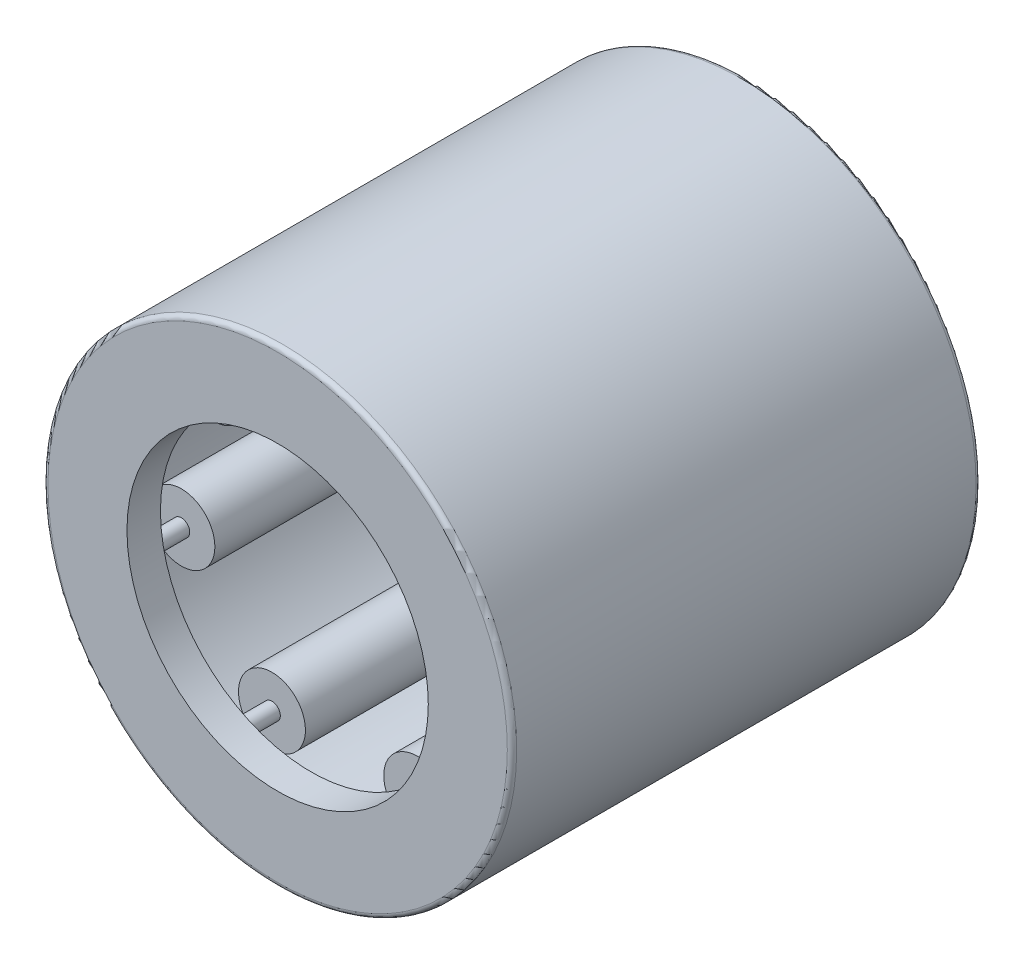
ISO-10303-21;
HEADER;
FILE_DESCRIPTION(('STEP AP214'),'2;1');
FILE_NAME('part.step','',(''),(''),'','','');
FILE_SCHEMA(('AUTOMOTIVE_DESIGN { 1 0 10303 214 1 1 1 1 }'));
ENDSEC;
DATA;
#1=APPLICATION_CONTEXT('core data for automotive mechanical design processes');
#2=APPLICATION_PROTOCOL_DEFINITION('international standard','automotive_design',2000,#1);
#3=PRODUCT_CONTEXT('',#1,'mechanical');
#4=PRODUCT('Part','Part','',(#3));
#5=PRODUCT_RELATED_PRODUCT_CATEGORY('part','',(#4));
#6=PRODUCT_DEFINITION_FORMATION('','',#4);
#7=PRODUCT_DEFINITION_CONTEXT('part definition',#1,'design');
#8=PRODUCT_DEFINITION('design','',#6,#7);
#9=PRODUCT_DEFINITION_SHAPE('','',#8);
#10=(LENGTH_UNIT() NAMED_UNIT(*) SI_UNIT(.MILLI.,.METRE.));
#11=(NAMED_UNIT(*) PLANE_ANGLE_UNIT() SI_UNIT($,.RADIAN.));
#12=(NAMED_UNIT(*) SI_UNIT($,.STERADIAN.) SOLID_ANGLE_UNIT());
#13=UNCERTAINTY_MEASURE_WITH_UNIT(LENGTH_MEASURE(1.E-05),#10,'distance_accuracy_value','');
#14=(GEOMETRIC_REPRESENTATION_CONTEXT(3) GLOBAL_UNCERTAINTY_ASSIGNED_CONTEXT((#13)) GLOBAL_UNIT_ASSIGNED_CONTEXT((#10,
#11,#12)) REPRESENTATION_CONTEXT('',''));
#15=CARTESIAN_POINT('',(0.,0.,0.));
#16=DIRECTION('',(0.,0.,1.));
#17=DIRECTION('',(1.,0.,0.));
#18=AXIS2_PLACEMENT_3D('',#15,#16,#17);
#19=CARTESIAN_POINT('',(-3.10289369604496,2.47447515112689,4.7625));
#20=DIRECTION('',(0.,0.,-1.));
#21=DIRECTION('',(-0.623489801858743,-0.781831482468022,0.));
#22=AXIS2_PLACEMENT_3D('',#19,#20,#21);
#23=PLANE('',#22);
#24=CARTESIAN_POINT('',(-3.10289369604496,2.47447515112689,4.7625));
#25=DIRECTION('',(0.,0.,1.));
#26=DIRECTION('',(0.623489801858743,0.781831482468022,0.));
#27=AXIS2_PLACEMENT_3D('',#24,#25,#26);
#28=CIRCLE('',#27,0.198437500000003);
#29=CARTESIAN_POINT('',(-2.97916993848861,2.62961983592914,4.7625));
#30=VERTEX_POINT('',#29);
#31=EDGE_CURVE('E11',#30,#30,#28,.T.);
#32=ORIENTED_EDGE('',*,*,#31,.T.);
#33=EDGE_LOOP('',(#32));
#34=FACE_BOUND('',#33,.T.);
#35=ADVANCED_FACE('F50',(#34),#23,.F.);
#36=CARTESIAN_POINT('',(-3.10289369604496,2.47447515112689,4.7625));
#37=DIRECTION('',(0.,0.,1.));
#38=DIRECTION('',(0.623489801858743,0.781831482468022,0.));
#39=AXIS2_PLACEMENT_3D('',#36,#37,#38);
#40=CYLINDRICAL_SURFACE('',#39,0.198437500000003);
#41=ORIENTED_EDGE('',*,*,#31,.F.);
#42=EDGE_LOOP('',(#41));
#43=FACE_BOUND('',#42,.T.);
#44=CARTESIAN_POINT('',(-3.10289369604496,2.47447515112689,-4.7625));
#45=DIRECTION('',(0.,0.,1.));
#46=DIRECTION('',(0.623489801858743,0.781831482468022,0.));
#47=AXIS2_PLACEMENT_3D('',#44,#45,#46);
#48=CIRCLE('',#47,0.198437500000003);
#49=CARTESIAN_POINT('',(-2.97916993848861,2.62961983592914,-4.7625));
#50=VERTEX_POINT('',#49);
#51=EDGE_CURVE('E56',#50,#50,#48,.T.);
#52=ORIENTED_EDGE('',*,*,#51,.T.);
#53=EDGE_LOOP('',(#52));
#54=FACE_BOUND('',#53,.T.);
#55=ADVANCED_FACE('F62',(#43,#54),#40,.T.);
#56=CARTESIAN_POINT('',(-3.10289369604496,2.47447515112689,-4.7625));
#57=DIRECTION('',(0.,0.,1.));
#58=DIRECTION('',(0.623489801858743,0.781831482468022,0.));
#59=AXIS2_PLACEMENT_3D('',#56,#57,#58);
#60=PLANE('',#59);
#61=ORIENTED_EDGE('',*,*,#51,.F.);
#62=EDGE_LOOP('',(#61));
#63=FACE_BOUND('',#62,.T.);
#64=ADVANCED_FACE('F64',(#63),#60,.F.);
#65=CLOSED_SHELL('',(#35,#55,#64));
#66=MANIFOLD_SOLID_BREP('B2',#65);
#67=CARTESIAN_POINT('',(-3.86924515147162,-0.883129956639085,4.7625));
#68=DIRECTION('',(0.,0.,-1.));
#69=DIRECTION('',(0.222520933956305,-0.974927912181826,0.));
#70=AXIS2_PLACEMENT_3D('',#67,#68,#69);
#71=PLANE('',#70);
#72=CARTESIAN_POINT('',(-3.86924515147162,-0.883129956639085,4.7625));
#73=DIRECTION('',(0.,0.,1.));
#74=DIRECTION('',(-0.222520933956305,0.974927912181826,0.));
#75=AXIS2_PLACEMENT_3D('',#72,#73,#74);
#76=CIRCLE('',#75,0.198437500000003);
#77=CARTESIAN_POINT('',(-3.91340164930357,-0.689667699065501,4.7625));
#78=VERTEX_POINT('',#77);
#79=EDGE_CURVE('E49',#78,#78,#76,.T.);
#80=ORIENTED_EDGE('',*,*,#79,.T.);
#81=EDGE_LOOP('',(#80));
#82=FACE_BOUND('',#81,.T.);
#83=ADVANCED_FACE('F93',(#82),#71,.F.);
#84=CARTESIAN_POINT('',(-3.86924515147162,-0.883129956639085,4.7625));
#85=DIRECTION('',(0.,0.,1.));
#86=DIRECTION('',(-0.222520933956305,0.974927912181826,0.));
#87=AXIS2_PLACEMENT_3D('',#84,#85,#86);
#88=CYLINDRICAL_SURFACE('',#87,0.198437500000003);
#89=ORIENTED_EDGE('',*,*,#79,.F.);
#90=EDGE_LOOP('',(#89));
#91=FACE_BOUND('',#90,.T.);
#92=CARTESIAN_POINT('',(-3.86924515147162,-0.883129956639085,-4.7625));
#93=DIRECTION('',(0.,0.,1.));
#94=DIRECTION('',(-0.222520933956305,0.974927912181826,0.));
#95=AXIS2_PLACEMENT_3D('',#92,#93,#94);
#96=CIRCLE('',#95,0.198437500000003);
#97=CARTESIAN_POINT('',(-3.91340164930357,-0.689667699065501,-4.7625));
#98=VERTEX_POINT('',#97);
#99=EDGE_CURVE('E99',#98,#98,#96,.T.);
#100=ORIENTED_EDGE('',*,*,#99,.T.);
#101=EDGE_LOOP('',(#100));
#102=FACE_BOUND('',#101,.T.);
#103=ADVANCED_FACE('F105',(#91,#102),#88,.T.);
#104=CARTESIAN_POINT('',(-3.86924515147162,-0.883129956639085,-4.7625));
#105=DIRECTION('',(0.,0.,1.));
#106=DIRECTION('',(-0.222520933956305,0.974927912181826,0.));
#107=AXIS2_PLACEMENT_3D('',#104,#105,#106);
#108=PLANE('',#107);
#109=ORIENTED_EDGE('',*,*,#99,.F.);
#110=EDGE_LOOP('',(#109));
#111=FACE_BOUND('',#110,.T.);
#112=ADVANCED_FACE('F107',(#111),#108,.F.);
#113=CLOSED_SHELL('',(#83,#103,#112));
#114=MANIFOLD_SOLID_BREP('B6',#113);
#115=CARTESIAN_POINT('',(-1.72197608962284,-3.57572019448771,4.7625));
#116=DIRECTION('',(0.,0.,-1.));
#117=DIRECTION('',(0.900968867902416,-0.433883739117565,0.));
#118=AXIS2_PLACEMENT_3D('',#115,#116,#117);
#119=PLANE('',#118);
#120=CARTESIAN_POINT('',(-1.72197608962284,-3.57572019448771,4.7625));
#121=DIRECTION('',(0.,0.,1.));
#122=DIRECTION('',(-0.900968867902416,0.433883739117565,0.));
#123=AXIS2_PLACEMENT_3D('',#120,#121,#122);
#124=CIRCLE('',#123,0.198437500000003);
#125=CARTESIAN_POINT('',(-1.90076209934722,-3.48962139000657,4.7625));
#126=VERTEX_POINT('',#125);
#127=EDGE_CURVE('E92',#126,#126,#124,.T.);
#128=ORIENTED_EDGE('',*,*,#127,.T.);
#129=EDGE_LOOP('',(#128));
#130=FACE_BOUND('',#129,.T.);
#131=ADVANCED_FACE('F136',(#130),#119,.F.);
#132=CARTESIAN_POINT('',(-1.72197608962284,-3.57572019448771,4.7625));
#133=DIRECTION('',(0.,0.,1.));
#134=DIRECTION('',(-0.900968867902416,0.433883739117565,0.));
#135=AXIS2_PLACEMENT_3D('',#132,#133,#134);
#136=CYLINDRICAL_SURFACE('',#135,0.198437500000003);
#137=ORIENTED_EDGE('',*,*,#127,.F.);
#138=EDGE_LOOP('',(#137));
#139=FACE_BOUND('',#138,.T.);
#140=CARTESIAN_POINT('',(-1.72197608962284,-3.57572019448771,-4.7625));
#141=DIRECTION('',(0.,0.,1.));
#142=DIRECTION('',(-0.900968867902416,0.433883739117565,0.));
#143=AXIS2_PLACEMENT_3D('',#140,#141,#142);
#144=CIRCLE('',#143,0.198437500000003);
#145=CARTESIAN_POINT('',(-1.90076209934722,-3.48962139000657,-4.7625));
#146=VERTEX_POINT('',#145);
#147=EDGE_CURVE('E142',#146,#146,#144,.T.);
#148=ORIENTED_EDGE('',*,*,#147,.T.);
#149=EDGE_LOOP('',(#148));
#150=FACE_BOUND('',#149,.T.);
#151=ADVANCED_FACE('F148',(#139,#150),#136,.T.);
#152=CARTESIAN_POINT('',(-1.72197608962284,-3.57572019448771,-4.7625));
#153=DIRECTION('',(0.,0.,1.));
#154=DIRECTION('',(-0.900968867902416,0.433883739117565,0.));
#155=AXIS2_PLACEMENT_3D('',#152,#153,#154);
#156=PLANE('',#155);
#157=ORIENTED_EDGE('',*,*,#147,.F.);
#158=EDGE_LOOP('',(#157));
#159=FACE_BOUND('',#158,.T.);
#160=ADVANCED_FACE('F150',(#159),#156,.F.);
#161=CLOSED_SHELL('',(#131,#151,#160));
#162=MANIFOLD_SOLID_BREP('B44',#161);
#163=CARTESIAN_POINT('',(1.72197608962279,-3.57572019448774,4.7625));
#164=DIRECTION('',(0.,0.,-1.));
#165=DIRECTION('',(0.900968867902422,0.433883739117553,0.));
#166=AXIS2_PLACEMENT_3D('',#163,#164,#165);
#167=PLANE('',#166);
#168=CARTESIAN_POINT('',(1.72197608962279,-3.57572019448774,4.7625));
#169=DIRECTION('',(0.,0.,1.));
#170=DIRECTION('',(-0.900968867902422,-0.433883739117553,0.));
#171=AXIS2_PLACEMENT_3D('',#168,#169,#170);
#172=CIRCLE('',#171,0.198437500000003);
#173=CARTESIAN_POINT('',(1.5431900798984,-3.66181899896888,4.7625));
#174=VERTEX_POINT('',#173);
#175=EDGE_CURVE('E135',#174,#174,#172,.T.);
#176=ORIENTED_EDGE('',*,*,#175,.T.);
#177=EDGE_LOOP('',(#176));
#178=FACE_BOUND('',#177,.T.);
#179=ADVANCED_FACE('F179',(#178),#167,.F.);
#180=CARTESIAN_POINT('',(1.72197608962279,-3.57572019448774,4.7625));
#181=DIRECTION('',(0.,0.,1.));
#182=DIRECTION('',(-0.900968867902422,-0.433883739117553,0.));
#183=AXIS2_PLACEMENT_3D('',#180,#181,#182);
#184=CYLINDRICAL_SURFACE('',#183,0.198437500000003);
#185=ORIENTED_EDGE('',*,*,#175,.F.);
#186=EDGE_LOOP('',(#185));
#187=FACE_BOUND('',#186,.T.);
#188=CARTESIAN_POINT('',(1.72197608962279,-3.57572019448774,-4.7625));
#189=DIRECTION('',(0.,0.,1.));
#190=DIRECTION('',(-0.900968867902422,-0.433883739117553,0.));
#191=AXIS2_PLACEMENT_3D('',#188,#189,#190);
#192=CIRCLE('',#191,0.198437500000003);
#193=CARTESIAN_POINT('',(1.5431900798984,-3.66181899896888,-4.7625));
#194=VERTEX_POINT('',#193);
#195=EDGE_CURVE('E185',#194,#194,#192,.T.);
#196=ORIENTED_EDGE('',*,*,#195,.T.);
#197=EDGE_LOOP('',(#196));
#198=FACE_BOUND('',#197,.T.);
#199=ADVANCED_FACE('F191',(#187,#198),#184,.T.);
#200=CARTESIAN_POINT('',(1.72197608962279,-3.57572019448774,-4.7625));
#201=DIRECTION('',(0.,0.,1.));
#202=DIRECTION('',(-0.900968867902422,-0.433883739117553,0.));
#203=AXIS2_PLACEMENT_3D('',#200,#201,#202);
#204=PLANE('',#203);
#205=ORIENTED_EDGE('',*,*,#195,.F.);
#206=EDGE_LOOP('',(#205));
#207=FACE_BOUND('',#206,.T.);
#208=ADVANCED_FACE('F193',(#207),#204,.F.);
#209=CLOSED_SHELL('',(#179,#199,#208));
#210=MANIFOLD_SOLID_BREP('B87',#209);
#211=CARTESIAN_POINT('',(3.86924515147161,-0.883129956639138,4.7625));
#212=DIRECTION('',(0.,0.,-1.));
#213=DIRECTION('',(0.222520933956318,0.974927912181823,0.));
#214=AXIS2_PLACEMENT_3D('',#211,#212,#213);
#215=PLANE('',#214);
#216=CARTESIAN_POINT('',(3.86924515147161,-0.883129956639138,4.7625));
#217=DIRECTION('',(0.,0.,1.));
#218=DIRECTION('',(-0.222520933956318,-0.974927912181823,0.));
#219=AXIS2_PLACEMENT_3D('',#216,#217,#218);
#220=CIRCLE('',#219,0.198437500000003);
#221=CARTESIAN_POINT('',(3.82508865363965,-1.07659221421272,4.7625));
#222=VERTEX_POINT('',#221);
#223=EDGE_CURVE('E178',#222,#222,#220,.T.);
#224=ORIENTED_EDGE('',*,*,#223,.T.);
#225=EDGE_LOOP('',(#224));
#226=FACE_BOUND('',#225,.T.);
#227=ADVANCED_FACE('F222',(#226),#215,.F.);
#228=CARTESIAN_POINT('',(3.86924515147161,-0.883129956639138,4.7625));
#229=DIRECTION('',(0.,0.,1.));
#230=DIRECTION('',(-0.222520933956318,-0.974927912181823,0.));
#231=AXIS2_PLACEMENT_3D('',#228,#229,#230);
#232=CYLINDRICAL_SURFACE('',#231,0.198437500000003);
#233=ORIENTED_EDGE('',*,*,#223,.F.);
#234=EDGE_LOOP('',(#233));
#235=FACE_BOUND('',#234,.T.);
#236=CARTESIAN_POINT('',(3.86924515147161,-0.883129956639138,-4.7625));
#237=DIRECTION('',(0.,0.,1.));
#238=DIRECTION('',(-0.222520933956318,-0.974927912181823,0.));
#239=AXIS2_PLACEMENT_3D('',#236,#237,#238);
#240=CIRCLE('',#239,0.198437500000003);
#241=CARTESIAN_POINT('',(3.82508865363965,-1.07659221421272,-4.7625));
#242=VERTEX_POINT('',#241);
#243=EDGE_CURVE('E228',#242,#242,#240,.T.);
#244=ORIENTED_EDGE('',*,*,#243,.T.);
#245=EDGE_LOOP('',(#244));
#246=FACE_BOUND('',#245,.T.);
#247=ADVANCED_FACE('F234',(#235,#246),#232,.T.);
#248=CARTESIAN_POINT('',(3.86924515147161,-0.883129956639138,-4.7625));
#249=DIRECTION('',(0.,0.,1.));
#250=DIRECTION('',(-0.222520933956318,-0.974927912181823,0.));
#251=AXIS2_PLACEMENT_3D('',#248,#249,#250);
#252=PLANE('',#251);
#253=ORIENTED_EDGE('',*,*,#243,.F.);
#254=EDGE_LOOP('',(#253));
#255=FACE_BOUND('',#254,.T.);
#256=ADVANCED_FACE('F236',(#255),#252,.F.);
#257=CLOSED_SHELL('',(#227,#247,#256));
#258=MANIFOLD_SOLID_BREP('B130',#257);
#259=CARTESIAN_POINT('',(3.102893696045,2.47447515112684,4.7625));
#260=DIRECTION('',(0.,0.,-1.));
#261=DIRECTION('',(-0.623489801858732,0.781831482468031,0.));
#262=AXIS2_PLACEMENT_3D('',#259,#260,#261);
#263=PLANE('',#262);
#264=CARTESIAN_POINT('',(3.102893696045,2.47447515112684,4.7625));
#265=DIRECTION('',(0.,0.,1.));
#266=DIRECTION('',(0.623489801858732,-0.781831482468031,0.));
#267=AXIS2_PLACEMENT_3D('',#264,#265,#266);
#268=CIRCLE('',#267,0.198437500000003);
#269=CARTESIAN_POINT('',(3.22661745360134,2.31933046632459,4.7625));
#270=VERTEX_POINT('',#269);
#271=EDGE_CURVE('E221',#270,#270,#268,.T.);
#272=ORIENTED_EDGE('',*,*,#271,.T.);
#273=EDGE_LOOP('',(#272));
#274=FACE_BOUND('',#273,.T.);
#275=ADVANCED_FACE('F265',(#274),#263,.F.);
#276=CARTESIAN_POINT('',(3.102893696045,2.47447515112684,4.7625));
#277=DIRECTION('',(0.,0.,1.));
#278=DIRECTION('',(0.623489801858732,-0.781831482468031,0.));
#279=AXIS2_PLACEMENT_3D('',#276,#277,#278);
#280=CYLINDRICAL_SURFACE('',#279,0.198437500000003);
#281=ORIENTED_EDGE('',*,*,#271,.F.);
#282=EDGE_LOOP('',(#281));
#283=FACE_BOUND('',#282,.T.);
#284=CARTESIAN_POINT('',(3.102893696045,2.47447515112684,-4.7625));
#285=DIRECTION('',(0.,0.,1.));
#286=DIRECTION('',(0.623489801858732,-0.781831482468031,0.));
#287=AXIS2_PLACEMENT_3D('',#284,#285,#286);
#288=CIRCLE('',#287,0.198437500000003);
#289=CARTESIAN_POINT('',(3.22661745360134,2.31933046632459,-4.7625));
#290=VERTEX_POINT('',#289);
#291=EDGE_CURVE('E271',#290,#290,#288,.T.);
#292=ORIENTED_EDGE('',*,*,#291,.T.);
#293=EDGE_LOOP('',(#292));
#294=FACE_BOUND('',#293,.T.);
#295=ADVANCED_FACE('F277',(#283,#294),#280,.T.);
#296=CARTESIAN_POINT('',(3.102893696045,2.47447515112684,-4.7625));
#297=DIRECTION('',(0.,0.,1.));
#298=DIRECTION('',(0.623489801858732,-0.781831482468031,0.));
#299=AXIS2_PLACEMENT_3D('',#296,#297,#298);
#300=PLANE('',#299);
#301=ORIENTED_EDGE('',*,*,#291,.F.);
#302=EDGE_LOOP('',(#301));
#303=FACE_BOUND('',#302,.T.);
#304=ADVANCED_FACE('F279',(#303),#300,.F.);
#305=CLOSED_SHELL('',(#275,#295,#304));
#306=MANIFOLD_SOLID_BREP('B173',#305);
#307=CARTESIAN_POINT('',(-3.72347243525396,2.96937018135226,-3.96875));
#308=DIRECTION('',(0.,0.,1.));
#309=DIRECTION('',(0.781831482468022,-0.623489801858743,0.));
#310=AXIS2_PLACEMENT_3D('',#307,#308,#309);
#311=PLANE('',#310);
#312=CARTESIAN_POINT('',(-3.10289369604496,2.47447515112689,-3.96875));
#313=DIRECTION('',(0.,0.,1.));
#314=DIRECTION('',(0.781831482468022,-0.623489801858743,0.));
#315=AXIS2_PLACEMENT_3D('',#312,#313,#314);
#316=CIRCLE('',#315,0.793749999999998);
#317=CARTESIAN_POINT('',(-2.48231495683597,1.97958012090151,-3.96875));
#318=VERTEX_POINT('',#317);
#319=EDGE_CURVE('E322',#318,#318,#316,.T.);
#320=ORIENTED_EDGE('',*,*,#319,.F.);
#321=EDGE_LOOP('',(#320));
#322=FACE_BOUND('',#321,.T.);
#323=CARTESIAN_POINT('',(-3.10289369604496,2.47447515112689,-3.96875));
#324=DIRECTION('',(0.,0.,1.));
#325=DIRECTION('',(0.781831482468022,-0.623489801858743,0.));
#326=AXIS2_PLACEMENT_3D('',#323,#324,#325);
#327=CIRCLE('',#326,0.1984375);
#328=CARTESIAN_POINT('',(-2.94774901124272,2.35075139357054,-3.96875));
#329=VERTEX_POINT('',#328);
#330=EDGE_CURVE('E264',#329,#329,#327,.T.);
#331=ORIENTED_EDGE('',*,*,#330,.T.);
#332=EDGE_LOOP('',(#331));
#333=FACE_BOUND('',#332,.T.);
#334=ADVANCED_FACE('F308',(#322,#333),#311,.F.);
#335=CARTESIAN_POINT('',(-3.10289369604496,2.47447515112689,3.96875));
#336=DIRECTION('',(0.,0.,1.));
#337=DIRECTION('',(0.781831482468022,-0.623489801858743,0.));
#338=AXIS2_PLACEMENT_3D('',#335,#336,#337);
#339=CYLINDRICAL_SURFACE('',#338,0.1984375);
#340=ORIENTED_EDGE('',*,*,#330,.F.);
#341=EDGE_LOOP('',(#340));
#342=FACE_BOUND('',#341,.T.);
#343=CARTESIAN_POINT('',(-3.10289369604496,2.47447515112689,3.96875));
#344=DIRECTION('',(0.,0.,1.));
#345=DIRECTION('',(0.781831482468022,-0.623489801858743,0.));
#346=AXIS2_PLACEMENT_3D('',#343,#344,#345);
#347=CIRCLE('',#346,0.1984375);
#348=CARTESIAN_POINT('',(-2.94774901124272,2.35075139357054,3.96875));
#349=VERTEX_POINT('',#348);
#350=EDGE_CURVE('E314',#349,#349,#347,.T.);
#351=ORIENTED_EDGE('',*,*,#350,.T.);
#352=EDGE_LOOP('',(#351));
#353=FACE_BOUND('',#352,.T.);
#354=ADVANCED_FACE('F331',(#342,#353),#339,.F.);
#355=CARTESIAN_POINT('',(-3.72347243525396,2.96937018135226,3.96875));
#356=DIRECTION('',(0.,0.,-1.));
#357=DIRECTION('',(-0.781831482468022,0.623489801858743,0.));
#358=AXIS2_PLACEMENT_3D('',#355,#356,#357);
#359=PLANE('',#358);
#360=ORIENTED_EDGE('',*,*,#350,.F.);
#361=EDGE_LOOP('',(#360));
#362=FACE_BOUND('',#361,.T.);
#363=CARTESIAN_POINT('',(-3.10289369604496,2.47447515112689,3.96875));
#364=DIRECTION('',(0.,0.,1.));
#365=DIRECTION('',(0.781831482468022,-0.623489801858743,0.));
#366=AXIS2_PLACEMENT_3D('',#363,#364,#365);
#367=CIRCLE('',#366,0.793749999999998);
#368=CARTESIAN_POINT('',(-2.48231495683597,1.97958012090151,3.96875));
#369=VERTEX_POINT('',#368);
#370=EDGE_CURVE('E318',#369,#369,#367,.T.);
#371=ORIENTED_EDGE('',*,*,#370,.T.);
#372=EDGE_LOOP('',(#371));
#373=FACE_BOUND('',#372,.T.);
#374=ADVANCED_FACE('F335',(#362,#373),#359,.F.);
#375=CARTESIAN_POINT('',(-3.10289369604496,2.47447515112689,3.96875));
#376=DIRECTION('',(0.,0.,1.));
#377=DIRECTION('',(0.781831482468022,-0.623489801858743,0.));
#378=AXIS2_PLACEMENT_3D('',#375,#376,#377);
#379=CYLINDRICAL_SURFACE('',#378,0.793749999999998);
#380=ORIENTED_EDGE('',*,*,#370,.F.);
#381=EDGE_LOOP('',(#380));
#382=FACE_BOUND('',#381,.T.);
#383=ORIENTED_EDGE('',*,*,#319,.T.);
#384=EDGE_LOOP('',(#383));
#385=FACE_BOUND('',#384,.T.);
#386=ADVANCED_FACE('F328',(#382,#385),#379,.T.);
#387=CLOSED_SHELL('',(#334,#354,#374,#386));
#388=MANIFOLD_SOLID_BREP('B216',#387);
#389=CARTESIAN_POINT('',(-4.64309418176595,-1.0597559479669,-3.96875));
#390=DIRECTION('',(0.,0.,1.));
#391=DIRECTION('',(0.974927912181826,0.222520933956305,0.));
#392=AXIS2_PLACEMENT_3D('',#389,#390,#391);
#393=PLANE('',#392);
#394=CARTESIAN_POINT('',(-3.86924515147162,-0.883129956639086,-3.96875));
#395=DIRECTION('',(0.,0.,1.));
#396=DIRECTION('',(0.974927912181826,0.222520933956305,0.));
#397=AXIS2_PLACEMENT_3D('',#394,#395,#396);
#398=CIRCLE('',#397,0.793749999999998);
#399=CARTESIAN_POINT('',(-3.0953961211773,-0.706503965311269,-3.96875));
#400=VERTEX_POINT('',#399);
#401=EDGE_CURVE('E384',#400,#400,#398,.T.);
#402=ORIENTED_EDGE('',*,*,#401,.F.);
#403=EDGE_LOOP('',(#402));
#404=FACE_BOUND('',#403,.T.);
#405=CARTESIAN_POINT('',(-3.86924515147162,-0.883129956639086,-3.96875));
#406=DIRECTION('',(0.,0.,1.));
#407=DIRECTION('',(0.974927912181826,0.222520933956305,0.));
#408=AXIS2_PLACEMENT_3D('',#405,#406,#407);
#409=CIRCLE('',#408,0.1984375);
#410=CARTESIAN_POINT('',(-3.67578289389804,-0.838973458807132,-3.96875));
#411=VERTEX_POINT('',#410);
#412=EDGE_CURVE('E307',#411,#411,#409,.T.);
#413=ORIENTED_EDGE('',*,*,#412,.T.);
#414=EDGE_LOOP('',(#413));
#415=FACE_BOUND('',#414,.T.);
#416=ADVANCED_FACE('F370',(#404,#415),#393,.F.);
#417=CARTESIAN_POINT('',(-3.86924515147162,-0.883129956639086,3.96875));
#418=DIRECTION('',(0.,0.,1.));
#419=DIRECTION('',(0.974927912181826,0.222520933956305,0.));
#420=AXIS2_PLACEMENT_3D('',#417,#418,#419);
#421=CYLINDRICAL_SURFACE('',#420,0.1984375);
#422=ORIENTED_EDGE('',*,*,#412,.F.);
#423=EDGE_LOOP('',(#422));
#424=FACE_BOUND('',#423,.T.);
#425=CARTESIAN_POINT('',(-3.86924515147162,-0.883129956639086,3.96875));
#426=DIRECTION('',(0.,0.,1.));
#427=DIRECTION('',(0.974927912181826,0.222520933956305,0.));
#428=AXIS2_PLACEMENT_3D('',#425,#426,#427);
#429=CIRCLE('',#428,0.1984375);
#430=CARTESIAN_POINT('',(-3.67578289389804,-0.838973458807132,3.96875));
#431=VERTEX_POINT('',#430);
#432=EDGE_CURVE('E376',#431,#431,#429,.T.);
#433=ORIENTED_EDGE('',*,*,#432,.T.);
#434=EDGE_LOOP('',(#433));
#435=FACE_BOUND('',#434,.T.);
#436=ADVANCED_FACE('F393',(#424,#435),#421,.F.);
#437=CARTESIAN_POINT('',(-4.64309418176595,-1.0597559479669,3.96875));
#438=DIRECTION('',(0.,0.,-1.));
#439=DIRECTION('',(-0.974927912181826,-0.222520933956305,0.));
#440=AXIS2_PLACEMENT_3D('',#437,#438,#439);
#441=PLANE('',#440);
#442=ORIENTED_EDGE('',*,*,#432,.F.);
#443=EDGE_LOOP('',(#442));
#444=FACE_BOUND('',#443,.T.);
#445=CARTESIAN_POINT('',(-3.86924515147162,-0.883129956639086,3.96875));
#446=DIRECTION('',(0.,0.,1.));
#447=DIRECTION('',(0.974927912181826,0.222520933956305,0.));
#448=AXIS2_PLACEMENT_3D('',#445,#446,#447);
#449=CIRCLE('',#448,0.793749999999998);
#450=CARTESIAN_POINT('',(-3.0953961211773,-0.706503965311269,3.96875));
#451=VERTEX_POINT('',#450);
#452=EDGE_CURVE('E380',#451,#451,#449,.T.);
#453=ORIENTED_EDGE('',*,*,#452,.T.);
#454=EDGE_LOOP('',(#453));
#455=FACE_BOUND('',#454,.T.);
#456=ADVANCED_FACE('F397',(#444,#455),#441,.F.);
#457=CARTESIAN_POINT('',(-3.86924515147162,-0.883129956639086,3.96875));
#458=DIRECTION('',(0.,0.,1.));
#459=DIRECTION('',(0.974927912181826,0.222520933956305,0.));
#460=AXIS2_PLACEMENT_3D('',#457,#458,#459);
#461=CYLINDRICAL_SURFACE('',#460,0.793749999999998);
#462=ORIENTED_EDGE('',*,*,#452,.F.);
#463=EDGE_LOOP('',(#462));
#464=FACE_BOUND('',#463,.T.);
#465=ORIENTED_EDGE('',*,*,#401,.T.);
#466=EDGE_LOOP('',(#465));
#467=FACE_BOUND('',#466,.T.);
#468=ADVANCED_FACE('F390',(#464,#467),#461,.T.);
#469=CLOSED_SHELL('',(#416,#436,#456,#468));
#470=MANIFOLD_SOLID_BREP('B259',#469);
#471=CARTESIAN_POINT('',(-2.0663713075474,-4.29086423338526,-3.96875));
#472=DIRECTION('',(0.,0.,1.));
#473=DIRECTION('',(0.433883739117565,0.900968867902416,0.));
#474=AXIS2_PLACEMENT_3D('',#471,#472,#473);
#475=PLANE('',#474);
#476=CARTESIAN_POINT('',(-1.72197608962284,-3.57572019448771,-3.96875));
#477=DIRECTION('',(0.,0.,1.));
#478=DIRECTION('',(0.433883739117565,0.900968867902416,0.));
#479=AXIS2_PLACEMENT_3D('',#476,#477,#478);
#480=CIRCLE('',#479,0.793749999999998);
#481=CARTESIAN_POINT('',(-1.37758087169827,-2.86057615559017,-3.96875));
#482=VERTEX_POINT('',#481);
#483=EDGE_CURVE('E446',#482,#482,#480,.T.);
#484=ORIENTED_EDGE('',*,*,#483,.F.);
#485=EDGE_LOOP('',(#484));
#486=FACE_BOUND('',#485,.T.);
#487=CARTESIAN_POINT('',(-1.72197608962284,-3.57572019448771,-3.96875));
#488=DIRECTION('',(0.,0.,1.));
#489=DIRECTION('',(0.433883739117565,0.900968867902416,0.));
#490=AXIS2_PLACEMENT_3D('',#487,#488,#489);
#491=CIRCLE('',#490,0.1984375);
#492=CARTESIAN_POINT('',(-1.6358772851417,-3.39693418476333,-3.96875));
#493=VERTEX_POINT('',#492);
#494=EDGE_CURVE('E369',#493,#493,#491,.T.);
#495=ORIENTED_EDGE('',*,*,#494,.T.);
#496=EDGE_LOOP('',(#495));
#497=FACE_BOUND('',#496,.T.);
#498=ADVANCED_FACE('F432',(#486,#497),#475,.F.);
#499=CARTESIAN_POINT('',(-1.72197608962284,-3.57572019448771,3.96875));
#500=DIRECTION('',(0.,0.,1.));
#501=DIRECTION('',(0.433883739117565,0.900968867902416,0.));
#502=AXIS2_PLACEMENT_3D('',#499,#500,#501);
#503=CYLINDRICAL_SURFACE('',#502,0.1984375);
#504=ORIENTED_EDGE('',*,*,#494,.F.);
#505=EDGE_LOOP('',(#504));
#506=FACE_BOUND('',#505,.T.);
#507=CARTESIAN_POINT('',(-1.72197608962284,-3.57572019448771,3.96875));
#508=DIRECTION('',(0.,0.,1.));
#509=DIRECTION('',(0.433883739117565,0.900968867902416,0.));
#510=AXIS2_PLACEMENT_3D('',#507,#508,#509);
#511=CIRCLE('',#510,0.1984375);
#512=CARTESIAN_POINT('',(-1.6358772851417,-3.39693418476333,3.96875));
#513=VERTEX_POINT('',#512);
#514=EDGE_CURVE('E438',#513,#513,#511,.T.);
#515=ORIENTED_EDGE('',*,*,#514,.T.);
#516=EDGE_LOOP('',(#515));
#517=FACE_BOUND('',#516,.T.);
#518=ADVANCED_FACE('F455',(#506,#517),#503,.F.);
#519=CARTESIAN_POINT('',(-2.0663713075474,-4.29086423338525,3.96875));
#520=DIRECTION('',(0.,0.,-1.));
#521=DIRECTION('',(-0.433883739117565,-0.900968867902416,0.));
#522=AXIS2_PLACEMENT_3D('',#519,#520,#521);
#523=PLANE('',#522);
#524=ORIENTED_EDGE('',*,*,#514,.F.);
#525=EDGE_LOOP('',(#524));
#526=FACE_BOUND('',#525,.T.);
#527=CARTESIAN_POINT('',(-1.72197608962284,-3.57572019448771,3.96875));
#528=DIRECTION('',(0.,0.,1.));
#529=DIRECTION('',(0.433883739117565,0.900968867902416,0.));
#530=AXIS2_PLACEMENT_3D('',#527,#528,#529);
#531=CIRCLE('',#530,0.793749999999998);
#532=CARTESIAN_POINT('',(-1.37758087169827,-2.86057615559017,3.96875));
#533=VERTEX_POINT('',#532);
#534=EDGE_CURVE('E442',#533,#533,#531,.T.);
#535=ORIENTED_EDGE('',*,*,#534,.T.);
#536=EDGE_LOOP('',(#535));
#537=FACE_BOUND('',#536,.T.);
#538=ADVANCED_FACE('F459',(#526,#537),#523,.F.);
#539=CARTESIAN_POINT('',(-1.72197608962284,-3.57572019448771,3.96875));
#540=DIRECTION('',(0.,0.,1.));
#541=DIRECTION('',(0.433883739117565,0.900968867902416,0.));
#542=AXIS2_PLACEMENT_3D('',#539,#540,#541);
#543=CYLINDRICAL_SURFACE('',#542,0.793749999999998);
#544=ORIENTED_EDGE('',*,*,#534,.F.);
#545=EDGE_LOOP('',(#544));
#546=FACE_BOUND('',#545,.T.);
#547=ORIENTED_EDGE('',*,*,#483,.T.);
#548=EDGE_LOOP('',(#547));
#549=FACE_BOUND('',#548,.T.);
#550=ADVANCED_FACE('F452',(#546,#549),#543,.T.);
#551=CLOSED_SHELL('',(#498,#518,#538,#550));
#552=MANIFOLD_SOLID_BREP('B302',#551);
#553=CARTESIAN_POINT('',(2.06637130754734,-4.29086423338528,-3.96875));
#554=DIRECTION('',(0.,0.,1.));
#555=DIRECTION('',(-0.433883739117553,0.900968867902422,0.));
#556=AXIS2_PLACEMENT_3D('',#553,#554,#555);
#557=PLANE('',#556);
#558=CARTESIAN_POINT('',(1.72197608962279,-3.57572019448774,-3.96875));
#559=DIRECTION('',(0.,0.,1.));
#560=DIRECTION('',(-0.433883739117553,0.900968867902422,0.));
#561=AXIS2_PLACEMENT_3D('',#558,#559,#560);
#562=CIRCLE('',#561,0.793749999999998);
#563=CARTESIAN_POINT('',(1.37758087169823,-2.86057615559019,-3.96875));
#564=VERTEX_POINT('',#563);
#565=EDGE_CURVE('E508',#564,#564,#562,.T.);
#566=ORIENTED_EDGE('',*,*,#565,.F.);
#567=EDGE_LOOP('',(#566));
#568=FACE_BOUND('',#567,.T.);
#569=CARTESIAN_POINT('',(1.72197608962279,-3.57572019448774,-3.96875));
#570=DIRECTION('',(0.,0.,1.));
#571=DIRECTION('',(-0.433883739117553,0.900968867902422,0.));
#572=AXIS2_PLACEMENT_3D('',#569,#570,#571);
#573=CIRCLE('',#572,0.1984375);
#574=CARTESIAN_POINT('',(1.63587728514165,-3.39693418476335,-3.96875));
#575=VERTEX_POINT('',#574);
#576=EDGE_CURVE('E431',#575,#575,#573,.T.);
#577=ORIENTED_EDGE('',*,*,#576,.T.);
#578=EDGE_LOOP('',(#577));
#579=FACE_BOUND('',#578,.T.);
#580=ADVANCED_FACE('F494',(#568,#579),#557,.F.);
#581=CARTESIAN_POINT('',(1.72197608962279,-3.57572019448774,3.96875));
#582=DIRECTION('',(0.,0.,1.));
#583=DIRECTION('',(-0.433883739117553,0.900968867902422,0.));
#584=AXIS2_PLACEMENT_3D('',#581,#582,#583);
#585=CYLINDRICAL_SURFACE('',#584,0.1984375);
#586=ORIENTED_EDGE('',*,*,#576,.F.);
#587=EDGE_LOOP('',(#586));
#588=FACE_BOUND('',#587,.T.);
#589=CARTESIAN_POINT('',(1.72197608962279,-3.57572019448774,3.96875));
#590=DIRECTION('',(0.,0.,1.));
#591=DIRECTION('',(-0.433883739117553,0.900968867902422,0.));
#592=AXIS2_PLACEMENT_3D('',#589,#590,#591);
#593=CIRCLE('',#592,0.1984375);
#594=CARTESIAN_POINT('',(1.63587728514165,-3.39693418476335,3.96875));
#595=VERTEX_POINT('',#594);
#596=EDGE_CURVE('E500',#595,#595,#593,.T.);
#597=ORIENTED_EDGE('',*,*,#596,.T.);
#598=EDGE_LOOP('',(#597));
#599=FACE_BOUND('',#598,.T.);
#600=ADVANCED_FACE('F517',(#588,#599),#585,.F.);
#601=CARTESIAN_POINT('',(2.06637130754734,-4.29086423338528,3.96875));
#602=DIRECTION('',(0.,0.,-1.));
#603=DIRECTION('',(0.433883739117553,-0.900968867902422,0.));
#604=AXIS2_PLACEMENT_3D('',#601,#602,#603);
#605=PLANE('',#604);
#606=ORIENTED_EDGE('',*,*,#596,.F.);
#607=EDGE_LOOP('',(#606));
#608=FACE_BOUND('',#607,.T.);
#609=CARTESIAN_POINT('',(1.72197608962279,-3.57572019448774,3.96875));
#610=DIRECTION('',(0.,0.,1.));
#611=DIRECTION('',(-0.433883739117553,0.900968867902422,0.));
#612=AXIS2_PLACEMENT_3D('',#609,#610,#611);
#613=CIRCLE('',#612,0.793749999999998);
#614=CARTESIAN_POINT('',(1.37758087169823,-2.86057615559019,3.96875));
#615=VERTEX_POINT('',#614);
#616=EDGE_CURVE('E504',#615,#615,#613,.T.);
#617=ORIENTED_EDGE('',*,*,#616,.T.);
#618=EDGE_LOOP('',(#617));
#619=FACE_BOUND('',#618,.T.);
#620=ADVANCED_FACE('F521',(#608,#619),#605,.F.);
#621=CARTESIAN_POINT('',(1.72197608962279,-3.57572019448774,3.96875));
#622=DIRECTION('',(0.,0.,1.));
#623=DIRECTION('',(-0.433883739117553,0.900968867902422,0.));
#624=AXIS2_PLACEMENT_3D('',#621,#622,#623);
#625=CYLINDRICAL_SURFACE('',#624,0.793749999999998);
#626=ORIENTED_EDGE('',*,*,#616,.F.);
#627=EDGE_LOOP('',(#626));
#628=FACE_BOUND('',#627,.T.);
#629=ORIENTED_EDGE('',*,*,#565,.T.);
#630=EDGE_LOOP('',(#629));
#631=FACE_BOUND('',#630,.T.);
#632=ADVANCED_FACE('F514',(#628,#631),#625,.T.);
#633=CLOSED_SHELL('',(#580,#600,#620,#632));
#634=MANIFOLD_SOLID_BREP('B364',#633);
#635=CARTESIAN_POINT('',(4.64309418176593,-1.05975594796697,-3.96875));
#636=DIRECTION('',(0.,0.,1.));
#637=DIRECTION('',(-0.974927912181823,0.222520933956318,0.));
#638=AXIS2_PLACEMENT_3D('',#635,#636,#637);
#639=PLANE('',#638);
#640=CARTESIAN_POINT('',(3.86924515147161,-0.883129956639138,-3.96875));
#641=DIRECTION('',(0.,0.,1.));
#642=DIRECTION('',(-0.974927912181823,0.222520933956318,0.));
#643=AXIS2_PLACEMENT_3D('',#640,#641,#642);
#644=CIRCLE('',#643,0.793749999999998);
#645=CARTESIAN_POINT('',(3.09539612117729,-0.706503965311311,-3.96875));
#646=VERTEX_POINT('',#645);
#647=EDGE_CURVE('E570',#646,#646,#644,.T.);
#648=ORIENTED_EDGE('',*,*,#647,.F.);
#649=EDGE_LOOP('',(#648));
#650=FACE_BOUND('',#649,.T.);
#651=CARTESIAN_POINT('',(3.86924515147161,-0.883129956639138,-3.96875));
#652=DIRECTION('',(0.,0.,1.));
#653=DIRECTION('',(-0.974927912181823,0.222520933956318,0.));
#654=AXIS2_PLACEMENT_3D('',#651,#652,#653);
#655=CIRCLE('',#654,0.1984375);
#656=CARTESIAN_POINT('',(3.67578289389803,-0.838973458807182,-3.96875));
#657=VERTEX_POINT('',#656);
#658=EDGE_CURVE('E493',#657,#657,#655,.T.);
#659=ORIENTED_EDGE('',*,*,#658,.T.);
#660=EDGE_LOOP('',(#659));
#661=FACE_BOUND('',#660,.T.);
#662=ADVANCED_FACE('F556',(#650,#661),#639,.F.);
#663=CARTESIAN_POINT('',(3.86924515147161,-0.883129956639138,3.96875));
#664=DIRECTION('',(0.,0.,1.));
#665=DIRECTION('',(-0.974927912181823,0.222520933956318,0.));
#666=AXIS2_PLACEMENT_3D('',#663,#664,#665);
#667=CYLINDRICAL_SURFACE('',#666,0.1984375);
#668=ORIENTED_EDGE('',*,*,#658,.F.);
#669=EDGE_LOOP('',(#668));
#670=FACE_BOUND('',#669,.T.);
#671=CARTESIAN_POINT('',(3.86924515147161,-0.883129956639138,3.96875));
#672=DIRECTION('',(0.,0.,1.));
#673=DIRECTION('',(-0.974927912181823,0.222520933956318,0.));
#674=AXIS2_PLACEMENT_3D('',#671,#672,#673);
#675=CIRCLE('',#674,0.1984375);
#676=CARTESIAN_POINT('',(3.67578289389803,-0.838973458807181,3.96875));
#677=VERTEX_POINT('',#676);
#678=EDGE_CURVE('E562',#677,#677,#675,.T.);
#679=ORIENTED_EDGE('',*,*,#678,.T.);
#680=EDGE_LOOP('',(#679));
#681=FACE_BOUND('',#680,.T.);
#682=ADVANCED_FACE('F579',(#670,#681),#667,.F.);
#683=CARTESIAN_POINT('',(4.64309418176593,-1.05975594796697,3.96875));
#684=DIRECTION('',(0.,0.,-1.));
#685=DIRECTION('',(0.974927912181823,-0.222520933956318,0.));
#686=AXIS2_PLACEMENT_3D('',#683,#684,#685);
#687=PLANE('',#686);
#688=ORIENTED_EDGE('',*,*,#678,.F.);
#689=EDGE_LOOP('',(#688));
#690=FACE_BOUND('',#689,.T.);
#691=CARTESIAN_POINT('',(3.86924515147161,-0.883129956639138,3.96875));
#692=DIRECTION('',(0.,0.,1.));
#693=DIRECTION('',(-0.974927912181823,0.222520933956318,0.));
#694=AXIS2_PLACEMENT_3D('',#691,#692,#693);
#695=CIRCLE('',#694,0.793749999999998);
#696=CARTESIAN_POINT('',(3.09539612117729,-0.706503965311311,3.96875));
#697=VERTEX_POINT('',#696);
#698=EDGE_CURVE('E566',#697,#697,#695,.T.);
#699=ORIENTED_EDGE('',*,*,#698,.T.);
#700=EDGE_LOOP('',(#699));
#701=FACE_BOUND('',#700,.T.);
#702=ADVANCED_FACE('F583',(#690,#701),#687,.F.);
#703=CARTESIAN_POINT('',(3.86924515147161,-0.883129956639138,3.96875));
#704=DIRECTION('',(0.,0.,1.));
#705=DIRECTION('',(-0.974927912181823,0.222520933956318,0.));
#706=AXIS2_PLACEMENT_3D('',#703,#704,#705);
#707=CYLINDRICAL_SURFACE('',#706,0.793749999999998);
#708=ORIENTED_EDGE('',*,*,#698,.F.);
#709=EDGE_LOOP('',(#708));
#710=FACE_BOUND('',#709,.T.);
#711=ORIENTED_EDGE('',*,*,#647,.T.);
#712=EDGE_LOOP('',(#711));
#713=FACE_BOUND('',#712,.T.);
#714=ADVANCED_FACE('F576',(#710,#713),#707,.T.);
#715=CLOSED_SHELL('',(#662,#682,#702,#714));
#716=MANIFOLD_SOLID_BREP('B426',#715);
#717=CARTESIAN_POINT('',(3.723472435254,2.96937018135221,-3.96875));
#718=DIRECTION('',(0.,0.,1.));
#719=DIRECTION('',(-0.781831482468031,-0.623489801858732,0.));
#720=AXIS2_PLACEMENT_3D('',#717,#718,#719);
#721=PLANE('',#720);
#722=CARTESIAN_POINT('',(3.102893696045,2.47447515112684,-3.96875));
#723=DIRECTION('',(0.,0.,1.));
#724=DIRECTION('',(-0.781831482468031,-0.623489801858732,0.));
#725=AXIS2_PLACEMENT_3D('',#722,#723,#724);
#726=CIRCLE('',#725,0.793749999999998);
#727=CARTESIAN_POINT('',(2.482314956836,1.97958012090148,-3.96875));
#728=VERTEX_POINT('',#727);
#729=EDGE_CURVE('E632',#728,#728,#726,.T.);
#730=ORIENTED_EDGE('',*,*,#729,.F.);
#731=EDGE_LOOP('',(#730));
#732=FACE_BOUND('',#731,.T.);
#733=CARTESIAN_POINT('',(3.102893696045,2.47447515112684,-3.96875));
#734=DIRECTION('',(0.,0.,1.));
#735=DIRECTION('',(-0.781831482468031,-0.623489801858732,0.));
#736=AXIS2_PLACEMENT_3D('',#733,#734,#735);
#737=CIRCLE('',#736,0.1984375);
#738=CARTESIAN_POINT('',(2.94774901124275,2.3507513935705,-3.96875));
#739=VERTEX_POINT('',#738);
#740=EDGE_CURVE('E555',#739,#739,#737,.T.);
#741=ORIENTED_EDGE('',*,*,#740,.T.);
#742=EDGE_LOOP('',(#741));
#743=FACE_BOUND('',#742,.T.);
#744=ADVANCED_FACE('F618',(#732,#743),#721,.F.);
#745=CARTESIAN_POINT('',(3.102893696045,2.47447515112684,3.96875));
#746=DIRECTION('',(0.,0.,1.));
#747=DIRECTION('',(-0.781831482468031,-0.623489801858732,0.));
#748=AXIS2_PLACEMENT_3D('',#745,#746,#747);
#749=CYLINDRICAL_SURFACE('',#748,0.1984375);
#750=ORIENTED_EDGE('',*,*,#740,.F.);
#751=EDGE_LOOP('',(#750));
#752=FACE_BOUND('',#751,.T.);
#753=CARTESIAN_POINT('',(3.102893696045,2.47447515112684,3.96875));
#754=DIRECTION('',(0.,0.,1.));
#755=DIRECTION('',(-0.781831482468031,-0.623489801858732,0.));
#756=AXIS2_PLACEMENT_3D('',#753,#754,#755);
#757=CIRCLE('',#756,0.1984375);
#758=CARTESIAN_POINT('',(2.94774901124275,2.3507513935705,3.96875));
#759=VERTEX_POINT('',#758);
#760=EDGE_CURVE('E624',#759,#759,#757,.T.);
#761=ORIENTED_EDGE('',*,*,#760,.T.);
#762=EDGE_LOOP('',(#761));
#763=FACE_BOUND('',#762,.T.);
#764=ADVANCED_FACE('F641',(#752,#763),#749,.F.);
#765=CARTESIAN_POINT('',(3.723472435254,2.96937018135221,3.96875));
#766=DIRECTION('',(0.,0.,-1.));
#767=DIRECTION('',(0.781831482468031,0.623489801858732,0.));
#768=AXIS2_PLACEMENT_3D('',#765,#766,#767);
#769=PLANE('',#768);
#770=ORIENTED_EDGE('',*,*,#760,.F.);
#771=EDGE_LOOP('',(#770));
#772=FACE_BOUND('',#771,.T.);
#773=CARTESIAN_POINT('',(3.102893696045,2.47447515112684,3.96875));
#774=DIRECTION('',(0.,0.,1.));
#775=DIRECTION('',(-0.781831482468031,-0.623489801858732,0.));
#776=AXIS2_PLACEMENT_3D('',#773,#774,#775);
#777=CIRCLE('',#776,0.793749999999998);
#778=CARTESIAN_POINT('',(2.482314956836,1.97958012090148,3.96875));
#779=VERTEX_POINT('',#778);
#780=EDGE_CURVE('E628',#779,#779,#777,.T.);
#781=ORIENTED_EDGE('',*,*,#780,.T.);
#782=EDGE_LOOP('',(#781));
#783=FACE_BOUND('',#782,.T.);
#784=ADVANCED_FACE('F645',(#772,#783),#769,.F.);
#785=CARTESIAN_POINT('',(3.102893696045,2.47447515112684,3.96875));
#786=DIRECTION('',(0.,0.,1.));
#787=DIRECTION('',(-0.781831482468031,-0.623489801858732,0.));
#788=AXIS2_PLACEMENT_3D('',#785,#786,#787);
#789=CYLINDRICAL_SURFACE('',#788,0.793749999999998);
#790=ORIENTED_EDGE('',*,*,#780,.F.);
#791=EDGE_LOOP('',(#790));
#792=FACE_BOUND('',#791,.T.);
#793=ORIENTED_EDGE('',*,*,#729,.T.);
#794=EDGE_LOOP('',(#793));
#795=FACE_BOUND('',#794,.T.);
#796=ADVANCED_FACE('F638',(#792,#795),#789,.T.);
#797=CLOSED_SHELL('',(#744,#764,#784,#796));
#798=MANIFOLD_SOLID_BREP('B488',#797);
#799=CARTESIAN_POINT('',(0.,3.96875,4.7625));
#800=DIRECTION('',(0.,0.,-1.));
#801=DIRECTION('',(-1.,0.,0.));
#802=AXIS2_PLACEMENT_3D('',#799,#800,#801);
#803=PLANE('',#802);
#804=CARTESIAN_POINT('',(0.,3.96875,4.7625));
#805=DIRECTION('',(0.,0.,1.));
#806=DIRECTION('',(1.,0.,0.));
#807=AXIS2_PLACEMENT_3D('',#804,#805,#806);
#808=CIRCLE('',#807,0.198437500000003);
#809=CARTESIAN_POINT('',(0.198437500000003,3.96875,4.7625));
#810=VERTEX_POINT('',#809);
#811=EDGE_CURVE('E617',#810,#810,#808,.T.);
#812=ORIENTED_EDGE('',*,*,#811,.T.);
#813=EDGE_LOOP('',(#812));
#814=FACE_BOUND('',#813,.T.);
#815=ADVANCED_FACE('F680',(#814),#803,.F.);
#816=CARTESIAN_POINT('',(0.,3.96875,4.7625));
#817=DIRECTION('',(0.,0.,1.));
#818=DIRECTION('',(1.,0.,0.));
#819=AXIS2_PLACEMENT_3D('',#816,#817,#818);
#820=CYLINDRICAL_SURFACE('',#819,0.198437500000003);
#821=ORIENTED_EDGE('',*,*,#811,.F.);
#822=EDGE_LOOP('',(#821));
#823=FACE_BOUND('',#822,.T.);
#824=CARTESIAN_POINT('',(0.,3.96875,-4.7625));
#825=DIRECTION('',(0.,0.,1.));
#826=DIRECTION('',(1.,0.,0.));
#827=AXIS2_PLACEMENT_3D('',#824,#825,#826);
#828=CIRCLE('',#827,0.198437500000003);
#829=CARTESIAN_POINT('',(0.198437500000003,3.96875,-4.7625));
#830=VERTEX_POINT('',#829);
#831=EDGE_CURVE('E686',#830,#830,#828,.T.);
#832=ORIENTED_EDGE('',*,*,#831,.T.);
#833=EDGE_LOOP('',(#832));
#834=FACE_BOUND('',#833,.T.);
#835=ADVANCED_FACE('F692',(#823,#834),#820,.T.);
#836=CARTESIAN_POINT('',(0.,3.96875,-4.7625));
#837=DIRECTION('',(0.,0.,1.));
#838=DIRECTION('',(1.,0.,0.));
#839=AXIS2_PLACEMENT_3D('',#836,#837,#838);
#840=PLANE('',#839);
#841=ORIENTED_EDGE('',*,*,#831,.F.);
#842=EDGE_LOOP('',(#841));
#843=FACE_BOUND('',#842,.T.);
#844=ADVANCED_FACE('F694',(#843),#840,.F.);
#845=CLOSED_SHELL('',(#815,#835,#844));
#846=MANIFOLD_SOLID_BREP('B550',#845);
#847=CARTESIAN_POINT('',(0.,4.7625,-3.96875));
#848=DIRECTION('',(0.,0.,1.));
#849=DIRECTION('',(0.,-1.,0.));
#850=AXIS2_PLACEMENT_3D('',#847,#848,#849);
#851=PLANE('',#850);
#852=CARTESIAN_POINT('',(0.,3.96875,-3.96875));
#853=DIRECTION('',(0.,0.,1.));
#854=DIRECTION('',(0.,-1.,0.));
#855=AXIS2_PLACEMENT_3D('',#852,#853,#854);
#856=CIRCLE('',#855,0.793749999999998);
#857=CARTESIAN_POINT('',(0.,3.175,-3.96875));
#858=VERTEX_POINT('',#857);
#859=EDGE_CURVE('E736',#858,#858,#856,.T.);
#860=ORIENTED_EDGE('',*,*,#859,.F.);
#861=EDGE_LOOP('',(#860));
#862=FACE_BOUND('',#861,.T.);
#863=CARTESIAN_POINT('',(0.,3.96875,-3.96875));
#864=DIRECTION('',(0.,0.,1.));
#865=DIRECTION('',(0.,-1.,0.));
#866=AXIS2_PLACEMENT_3D('',#863,#864,#865);
#867=CIRCLE('',#866,0.1984375);
#868=CARTESIAN_POINT('',(0.,3.7703125,-3.96875));
#869=VERTEX_POINT('',#868);
#870=EDGE_CURVE('E679',#869,#869,#867,.T.);
#871=ORIENTED_EDGE('',*,*,#870,.T.);
#872=EDGE_LOOP('',(#871));
#873=FACE_BOUND('',#872,.T.);
#874=ADVANCED_FACE('F722',(#862,#873),#851,.F.);
#875=CARTESIAN_POINT('',(0.,3.96875,3.96875));
#876=DIRECTION('',(0.,0.,1.));
#877=DIRECTION('',(0.,-1.,0.));
#878=AXIS2_PLACEMENT_3D('',#875,#876,#877);
#879=CYLINDRICAL_SURFACE('',#878,0.1984375);
#880=ORIENTED_EDGE('',*,*,#870,.F.);
#881=EDGE_LOOP('',(#880));
#882=FACE_BOUND('',#881,.T.);
#883=CARTESIAN_POINT('',(0.,3.96875,3.96875));
#884=DIRECTION('',(0.,0.,1.));
#885=DIRECTION('',(0.,-1.,0.));
#886=AXIS2_PLACEMENT_3D('',#883,#884,#885);
#887=CIRCLE('',#886,0.1984375);
#888=CARTESIAN_POINT('',(0.,3.7703125,3.96875));
#889=VERTEX_POINT('',#888);
#890=EDGE_CURVE('E728',#889,#889,#887,.T.);
#891=ORIENTED_EDGE('',*,*,#890,.T.);
#892=EDGE_LOOP('',(#891));
#893=FACE_BOUND('',#892,.T.);
#894=ADVANCED_FACE('F745',(#882,#893),#879,.F.);
#895=CARTESIAN_POINT('',(0.,4.7625,3.96875));
#896=DIRECTION('',(0.,0.,-1.));
#897=DIRECTION('',(0.,1.,0.));
#898=AXIS2_PLACEMENT_3D('',#895,#896,#897);
#899=PLANE('',#898);
#900=ORIENTED_EDGE('',*,*,#890,.F.);
#901=EDGE_LOOP('',(#900));
#902=FACE_BOUND('',#901,.T.);
#903=CARTESIAN_POINT('',(0.,3.96875,3.96875));
#904=DIRECTION('',(0.,0.,1.));
#905=DIRECTION('',(0.,-1.,0.));
#906=AXIS2_PLACEMENT_3D('',#903,#904,#905);
#907=CIRCLE('',#906,0.793749999999998);
#908=CARTESIAN_POINT('',(0.,3.175,3.96875));
#909=VERTEX_POINT('',#908);
#910=EDGE_CURVE('E732',#909,#909,#907,.T.);
#911=ORIENTED_EDGE('',*,*,#910,.T.);
#912=EDGE_LOOP('',(#911));
#913=FACE_BOUND('',#912,.T.);
#914=ADVANCED_FACE('F749',(#902,#913),#899,.F.);
#915=CARTESIAN_POINT('',(0.,3.96875,3.96875));
#916=DIRECTION('',(0.,0.,1.));
#917=DIRECTION('',(0.,-1.,0.));
#918=AXIS2_PLACEMENT_3D('',#915,#916,#917);
#919=CYLINDRICAL_SURFACE('',#918,0.793749999999998);
#920=ORIENTED_EDGE('',*,*,#910,.F.);
#921=EDGE_LOOP('',(#920));
#922=FACE_BOUND('',#921,.T.);
#923=ORIENTED_EDGE('',*,*,#859,.T.);
#924=EDGE_LOOP('',(#923));
#925=FACE_BOUND('',#924,.T.);
#926=ADVANCED_FACE('F742',(#922,#925),#919,.T.);
#927=CLOSED_SHELL('',(#874,#894,#914,#926));
#928=MANIFOLD_SOLID_BREP('B612',#927);
#929=CARTESIAN_POINT('',(0.,5.55625,5.55625));
#930=DIRECTION('',(0.,0.,-1.));
#931=DIRECTION('',(-1.,0.,0.));
#932=AXIS2_PLACEMENT_3D('',#929,#930,#931);
#933=PLANE('',#932);
#934=CARTESIAN_POINT('',(0.,0.,5.55625));
#935=DIRECTION('',(0.,0.,-1.));
#936=DIRECTION('',(-1.,0.,0.));
#937=AXIS2_PLACEMENT_3D('',#934,#935,#936);
#938=CIRCLE('',#937,5.445125);
#939=CARTESIAN_POINT('',(-5.445125,0.,5.55625));
#940=VERTEX_POINT('',#939);
#941=EDGE_CURVE('E721',#940,#940,#938,.F.);
#942=ORIENTED_EDGE('',*,*,#941,.T.);
#943=EDGE_LOOP('',(#942));
#944=FACE_BOUND('',#943,.T.);
#945=CARTESIAN_POINT('',(0.,0.,5.55625));
#946=DIRECTION('',(0.,0.,1.));
#947=DIRECTION('',(1.,0.,0.));
#948=AXIS2_PLACEMENT_3D('',#945,#946,#947);
#949=CIRCLE('',#948,3.571875);
#950=CARTESIAN_POINT('',(3.571875,0.,5.55625));
#951=VERTEX_POINT('',#950);
#952=EDGE_CURVE('E796',#951,#951,#949,.T.);
#953=ORIENTED_EDGE('',*,*,#952,.F.);
#954=EDGE_LOOP('',(#953));
#955=FACE_BOUND('',#954,.T.);
#956=ADVANCED_FACE('F776',(#944,#955),#933,.F.);
#957=CARTESIAN_POINT('',(0.,0.,5.55625));
#958=DIRECTION('',(0.,0.,1.));
#959=DIRECTION('',(1.,0.,0.));
#960=AXIS2_PLACEMENT_3D('',#957,#958,#959);
#961=CYLINDRICAL_SURFACE('',#960,3.571875);
#962=CARTESIAN_POINT('',(0.,0.,4.7625));
#963=DIRECTION('',(0.,0.,1.));
#964=DIRECTION('',(1.,0.,0.));
#965=AXIS2_PLACEMENT_3D('',#962,#963,#964);
#966=CIRCLE('',#965,3.571875);
#967=CARTESIAN_POINT('',(3.571875,0.,4.7625));
#968=VERTEX_POINT('',#967);
#969=EDGE_CURVE('E799',#968,#968,#966,.T.);
#970=ORIENTED_EDGE('',*,*,#969,.F.);
#971=EDGE_LOOP('',(#970));
#972=FACE_BOUND('',#971,.T.);
#973=ORIENTED_EDGE('',*,*,#952,.T.);
#974=EDGE_LOOP('',(#973));
#975=FACE_BOUND('',#974,.T.);
#976=ADVANCED_FACE('F838',(#972,#975),#961,.F.);
#977=CARTESIAN_POINT('',(0.,3.571875,4.7625));
#978=DIRECTION('',(0.,0.,1.));
#979=DIRECTION('',(1.,0.,0.));
#980=AXIS2_PLACEMENT_3D('',#977,#978,#979);
#981=PLANE('',#980);
#982=CARTESIAN_POINT('',(0.,0.,4.7625));
#983=DIRECTION('',(0.,0.,1.));
#984=DIRECTION('',(1.,0.,0.));
#985=AXIS2_PLACEMENT_3D('',#982,#983,#984);
#986=CIRCLE('',#985,4.7625);
#987=CARTESIAN_POINT('',(4.7625,0.,4.7625));
#988=VERTEX_POINT('',#987);
#989=EDGE_CURVE('E802',#988,#988,#986,.T.);
#990=ORIENTED_EDGE('',*,*,#989,.F.);
#991=EDGE_LOOP('',(#990));
#992=FACE_BOUND('',#991,.T.);
#993=ORIENTED_EDGE('',*,*,#969,.T.);
#994=EDGE_LOOP('',(#993));
#995=FACE_BOUND('',#994,.T.);
#996=ADVANCED_FACE('F832',(#992,#995),#981,.F.);
#997=CARTESIAN_POINT('',(0.,0.,5.55625));
#998=DIRECTION('',(0.,0.,1.));
#999=DIRECTION('',(1.,0.,0.));
#1000=AXIS2_PLACEMENT_3D('',#997,#998,#999);
#1001=CYLINDRICAL_SURFACE('',#1000,4.7625);
#1002=CARTESIAN_POINT('',(0.,0.,-4.7625));
#1003=DIRECTION('',(0.,0.,1.));
#1004=DIRECTION('',(1.,0.,0.));
#1005=AXIS2_PLACEMENT_3D('',#1002,#1003,#1004);
#1006=CIRCLE('',#1005,4.7625);
#1007=CARTESIAN_POINT('',(4.7625,0.,-4.7625));
#1008=VERTEX_POINT('',#1007);
#1009=EDGE_CURVE('E805',#1008,#1008,#1006,.T.);
#1010=ORIENTED_EDGE('',*,*,#1009,.F.);
#1011=EDGE_LOOP('',(#1010));
#1012=FACE_BOUND('',#1011,.T.);
#1013=ORIENTED_EDGE('',*,*,#989,.T.);
#1014=EDGE_LOOP('',(#1013));
#1015=FACE_BOUND('',#1014,.T.);
#1016=ADVANCED_FACE('F826',(#1012,#1015),#1001,.F.);
#1017=CARTESIAN_POINT('',(0.,4.7625,-4.7625));
#1018=DIRECTION('',(0.,0.,-1.));
#1019=DIRECTION('',(-1.,0.,0.));
#1020=AXIS2_PLACEMENT_3D('',#1017,#1018,#1019);
#1021=PLANE('',#1020);
#1022=CARTESIAN_POINT('',(0.,0.,-4.7625));
#1023=DIRECTION('',(0.,0.,1.));
#1024=DIRECTION('',(1.,0.,0.));
#1025=AXIS2_PLACEMENT_3D('',#1022,#1023,#1024);
#1026=CIRCLE('',#1025,3.571875);
#1027=CARTESIAN_POINT('',(3.571875,0.,-4.7625));
#1028=VERTEX_POINT('',#1027);
#1029=EDGE_CURVE('E808',#1028,#1028,#1026,.T.);
#1030=ORIENTED_EDGE('',*,*,#1029,.F.);
#1031=EDGE_LOOP('',(#1030));
#1032=FACE_BOUND('',#1031,.T.);
#1033=ORIENTED_EDGE('',*,*,#1009,.T.);
#1034=EDGE_LOOP('',(#1033));
#1035=FACE_BOUND('',#1034,.T.);
#1036=ADVANCED_FACE('F820',(#1032,#1035),#1021,.F.);
#1037=CARTESIAN_POINT('',(0.,0.,5.55625));
#1038=DIRECTION('',(0.,0.,1.));
#1039=DIRECTION('',(1.,0.,0.));
#1040=AXIS2_PLACEMENT_3D('',#1037,#1038,#1039);
#1041=CYLINDRICAL_SURFACE('',#1040,3.571875);
#1042=CARTESIAN_POINT('',(0.,0.,-5.55625));
#1043=DIRECTION('',(0.,0.,1.));
#1044=DIRECTION('',(1.,0.,0.));
#1045=AXIS2_PLACEMENT_3D('',#1042,#1043,#1044);
#1046=CIRCLE('',#1045,3.571875);
#1047=CARTESIAN_POINT('',(3.571875,0.,-5.55625));
#1048=VERTEX_POINT('',#1047);
#1049=EDGE_CURVE('E811',#1048,#1048,#1046,.T.);
#1050=ORIENTED_EDGE('',*,*,#1049,.F.);
#1051=EDGE_LOOP('',(#1050));
#1052=FACE_BOUND('',#1051,.T.);
#1053=ORIENTED_EDGE('',*,*,#1029,.T.);
#1054=EDGE_LOOP('',(#1053));
#1055=FACE_BOUND('',#1054,.T.);
#1056=ADVANCED_FACE('F817',(#1052,#1055),#1041,.F.);
#1057=CARTESIAN_POINT('',(0.,3.571875,-5.55625));
#1058=DIRECTION('',(0.,0.,1.));
#1059=DIRECTION('',(1.,0.,0.));
#1060=AXIS2_PLACEMENT_3D('',#1057,#1058,#1059);
#1061=PLANE('',#1060);
#1062=CARTESIAN_POINT('',(0.,0.,-5.55625));
#1063=DIRECTION('',(0.,0.,1.));
#1064=DIRECTION('',(1.,0.,0.));
#1065=AXIS2_PLACEMENT_3D('',#1062,#1063,#1064);
#1066=CIRCLE('',#1065,5.445125);
#1067=CARTESIAN_POINT('',(5.445125,0.,-5.55625));
#1068=VERTEX_POINT('',#1067);
#1069=EDGE_CURVE('E783',#1068,#1068,#1066,.F.);
#1070=ORIENTED_EDGE('',*,*,#1069,.T.);
#1071=EDGE_LOOP('',(#1070));
#1072=FACE_BOUND('',#1071,.T.);
#1073=ORIENTED_EDGE('',*,*,#1049,.T.);
#1074=EDGE_LOOP('',(#1073));
#1075=FACE_BOUND('',#1074,.T.);
#1076=ADVANCED_FACE('F815',(#1072,#1075),#1061,.F.);
#1077=CARTESIAN_POINT('',(0.,0.,5.55625));
#1078=DIRECTION('',(0.,0.,1.));
#1079=DIRECTION('',(1.,0.,0.));
#1080=AXIS2_PLACEMENT_3D('',#1077,#1078,#1079);
#1081=CYLINDRICAL_SURFACE('',#1080,5.55625);
#1082=CARTESIAN_POINT('',(0.,0.,-5.445125));
#1083=DIRECTION('',(0.,0.,1.));
#1084=DIRECTION('',(1.,0.,0.));
#1085=AXIS2_PLACEMENT_3D('',#1082,#1083,#1084);
#1086=CIRCLE('',#1085,5.55625);
#1087=CARTESIAN_POINT('',(5.55625,0.,-5.445125));
#1088=VERTEX_POINT('',#1087);
#1089=EDGE_CURVE('E787',#1088,#1088,#1086,.T.);
#1090=ORIENTED_EDGE('',*,*,#1089,.T.);
#1091=EDGE_LOOP('',(#1090));
#1092=FACE_BOUND('',#1091,.T.);
#1093=CARTESIAN_POINT('',(0.,0.,5.445125));
#1094=DIRECTION('',(0.,0.,-1.));
#1095=DIRECTION('',(-1.,0.,0.));
#1096=AXIS2_PLACEMENT_3D('',#1093,#1094,#1095);
#1097=CIRCLE('',#1096,5.55625);
#1098=CARTESIAN_POINT('',(-5.55625,0.,5.445125));
#1099=VERTEX_POINT('',#1098);
#1100=EDGE_CURVE('E791',#1099,#1099,#1097,.T.);
#1101=ORIENTED_EDGE('',*,*,#1100,.T.);
#1102=EDGE_LOOP('',(#1101));
#1103=FACE_BOUND('',#1102,.T.);
#1104=ADVANCED_FACE('F854',(#1092,#1103),#1081,.T.);
#1105=CARTESIAN_POINT('',(0.,0.,-5.445125));
#1106=DIRECTION('',(0.,0.,1.));
#1107=DIRECTION('',(1.,0.,0.));
#1108=AXIS2_PLACEMENT_3D('',#1105,#1106,#1107);
#1109=TOROIDAL_SURFACE('',#1108,5.445125,0.111125);
#1110=ORIENTED_EDGE('',*,*,#1069,.F.);
#1111=EDGE_LOOP('',(#1110));
#1112=FACE_BOUND('',#1111,.T.);
#1113=ORIENTED_EDGE('',*,*,#1089,.F.);
#1114=EDGE_LOOP('',(#1113));
#1115=FACE_BOUND('',#1114,.T.);
#1116=ADVANCED_FACE('F852',(#1112,#1115),#1109,.T.);
#1117=CARTESIAN_POINT('',(0.,0.,5.445125));
#1118=DIRECTION('',(0.,0.,-1.));
#1119=DIRECTION('',(-1.,0.,0.));
#1120=AXIS2_PLACEMENT_3D('',#1117,#1118,#1119);
#1121=TOROIDAL_SURFACE('',#1120,5.445125,0.111125);
#1122=ORIENTED_EDGE('',*,*,#1100,.F.);
#1123=EDGE_LOOP('',(#1122));
#1124=FACE_BOUND('',#1123,.T.);
#1125=ORIENTED_EDGE('',*,*,#941,.F.);
#1126=EDGE_LOOP('',(#1125));
#1127=FACE_BOUND('',#1126,.T.);
#1128=ADVANCED_FACE('F778',(#1124,#1127),#1121,.T.);
#1129=CLOSED_SHELL('',(#956,#976,#996,#1016,#1036,#1056,#1076,#1104,#1116,#1128));
#1130=MANIFOLD_SOLID_BREP('B674',#1129);
#1131=ADVANCED_BREP_SHAPE_REPRESENTATION('',(#18,#66,#114,#162,#210,#258,#306,#388,#470,#552,
#634,#716,#798,#846,#928,#1130),#14);
#1132=SHAPE_DEFINITION_REPRESENTATION(#9,#1131);
ENDSEC;
END-ISO-10303-21;
